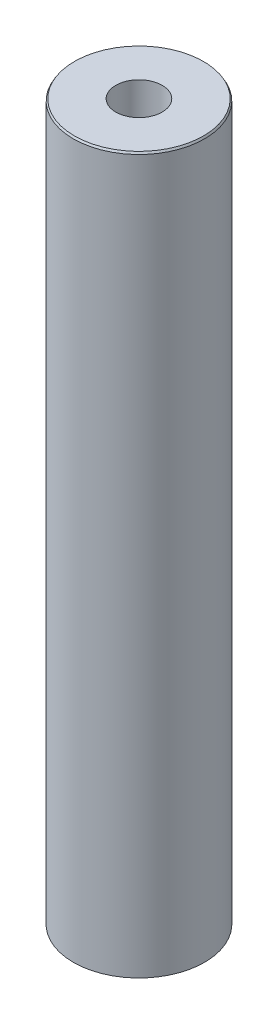
ISO-10303-21;
HEADER;
FILE_DESCRIPTION(('STEP AP214'),'2;1');
FILE_NAME('part.step','',(''),(''),'','','');
FILE_SCHEMA(('AUTOMOTIVE_DESIGN { 1 0 10303 214 1 1 1 1 }'));
ENDSEC;
DATA;
#1=APPLICATION_CONTEXT('core data for automotive mechanical design processes');
#2=APPLICATION_PROTOCOL_DEFINITION('international standard','automotive_design',2000,#1);
#3=PRODUCT_CONTEXT('',#1,'mechanical');
#4=PRODUCT('Part','Part','',(#3));
#5=PRODUCT_RELATED_PRODUCT_CATEGORY('part','',(#4));
#6=PRODUCT_DEFINITION_FORMATION('','',#4);
#7=PRODUCT_DEFINITION_CONTEXT('part definition',#1,'design');
#8=PRODUCT_DEFINITION('design','',#6,#7);
#9=PRODUCT_DEFINITION_SHAPE('','',#8);
#10=(LENGTH_UNIT() NAMED_UNIT(*) SI_UNIT(.MILLI.,.METRE.));
#11=(NAMED_UNIT(*) PLANE_ANGLE_UNIT() SI_UNIT($,.RADIAN.));
#12=(NAMED_UNIT(*) SI_UNIT($,.STERADIAN.) SOLID_ANGLE_UNIT());
#13=UNCERTAINTY_MEASURE_WITH_UNIT(LENGTH_MEASURE(1.E-05),#10,'distance_accuracy_value','');
#14=(GEOMETRIC_REPRESENTATION_CONTEXT(3) GLOBAL_UNCERTAINTY_ASSIGNED_CONTEXT((#13)) GLOBAL_UNIT_ASSIGNED_CONTEXT((#10,
#11,#12)) REPRESENTATION_CONTEXT('',''));
#15=CARTESIAN_POINT('',(0.,0.,0.));
#16=DIRECTION('',(0.,0.,1.));
#17=DIRECTION('',(1.,0.,0.));
#18=AXIS2_PLACEMENT_3D('',#15,#16,#17);
#19=CARTESIAN_POINT('',(0.,600.,0.));
#20=DIRECTION('',(0.,-1.,0.));
#21=DIRECTION('',(0.,0.,-1.));
#22=AXIS2_PLACEMENT_3D('',#19,#20,#21);
#23=CYLINDRICAL_SURFACE('',#22,55.);
#24=CARTESIAN_POINT('',(0.,598.37962724794,0.));
#25=DIRECTION('',(0.,1.,0.));
#26=DIRECTION('',(0.,0.,1.));
#27=AXIS2_PLACEMENT_3D('',#24,#25,#26);
#28=CIRCLE('',#27,55.);
#29=CARTESIAN_POINT('',(0.,598.37962724794,55.));
#30=VERTEX_POINT('',#29);
#31=EDGE_CURVE('E50',#30,#30,#28,.F.);
#32=ORIENTED_EDGE('',*,*,#31,.T.);
#33=EDGE_LOOP('',(#32));
#34=FACE_BOUND('',#33,.T.);
#35=CARTESIAN_POINT('',(0.,0.935522644589515,0.));
#36=DIRECTION('',(0.,1.,0.));
#37=DIRECTION('',(0.,0.,1.));
#38=AXIS2_PLACEMENT_3D('',#35,#36,#37);
#39=CIRCLE('',#38,55.);
#40=CARTESIAN_POINT('',(0.,0.935522644589515,55.));
#41=VERTEX_POINT('',#40);
#42=EDGE_CURVE('E51',#41,#41,#39,.T.);
#43=ORIENTED_EDGE('',*,*,#42,.T.);
#44=EDGE_LOOP('',(#43));
#45=FACE_BOUND('',#44,.T.);
#46=ADVANCED_FACE('F39',(#34,#45),#23,.T.);
#47=CARTESIAN_POINT('',(0.,600.,0.));
#48=DIRECTION('',(0.,1.,0.));
#49=DIRECTION('',(0.,0.,1.));
#50=AXIS2_PLACEMENT_3D('',#47,#48,#49);
#51=PLANE('',#50);
#52=CARTESIAN_POINT('',(0.,600.,0.));
#53=DIRECTION('',(0.,1.,0.));
#54=DIRECTION('',(0.,0.,1.));
#55=AXIS2_PLACEMENT_3D('',#52,#53,#54);
#56=CIRCLE('',#55,54.0644773554105);
#57=CARTESIAN_POINT('',(0.,600.,54.0644773554105));
#58=VERTEX_POINT('',#57);
#59=EDGE_CURVE('E54',#58,#58,#56,.T.);
#60=ORIENTED_EDGE('',*,*,#59,.T.);
#61=EDGE_LOOP('',(#60));
#62=FACE_BOUND('',#61,.T.);
#63=CARTESIAN_POINT('',(0.,600.,0.));
#64=DIRECTION('',(0.,1.,0.));
#65=DIRECTION('',(0.,0.,1.));
#66=AXIS2_PLACEMENT_3D('',#63,#64,#65);
#67=CIRCLE('',#66,19.4403279676686);
#68=CARTESIAN_POINT('',(0.,600.,19.4403279676686));
#69=VERTEX_POINT('',#68);
#70=EDGE_CURVE('E58',#69,#69,#67,.T.);
#71=ORIENTED_EDGE('',*,*,#70,.F.);
#72=EDGE_LOOP('',(#71));
#73=FACE_BOUND('',#72,.T.);
#74=ADVANCED_FACE('F69',(#62,#73),#51,.T.);
#75=CARTESIAN_POINT('',(0.,0.,0.));
#76=DIRECTION('',(0.,1.,0.));
#77=DIRECTION('',(0.,0.,1.));
#78=AXIS2_PLACEMENT_3D('',#75,#76,#77);
#79=PLANE('',#78);
#80=CARTESIAN_POINT('',(0.,0.,0.));
#81=DIRECTION('',(0.,1.,0.));
#82=DIRECTION('',(0.,0.,1.));
#83=AXIS2_PLACEMENT_3D('',#80,#81,#82);
#84=CIRCLE('',#83,53.3796272479398);
#85=CARTESIAN_POINT('',(0.,0.,53.3796272479398));
#86=VERTEX_POINT('',#85);
#87=EDGE_CURVE('E10',#86,#86,#84,.F.);
#88=ORIENTED_EDGE('',*,*,#87,.T.);
#89=EDGE_LOOP('',(#88));
#90=FACE_BOUND('',#89,.T.);
#91=CARTESIAN_POINT('',(0.,0.,0.));
#92=DIRECTION('',(0.,1.,0.));
#93=DIRECTION('',(0.,0.,1.));
#94=AXIS2_PLACEMENT_3D('',#91,#92,#93);
#95=CIRCLE('',#94,19.4403279676686);
#96=CARTESIAN_POINT('',(0.,0.,19.4403279676686));
#97=VERTEX_POINT('',#96);
#98=EDGE_CURVE('E63',#97,#97,#95,.T.);
#99=ORIENTED_EDGE('',*,*,#98,.T.);
#100=EDGE_LOOP('',(#99));
#101=FACE_BOUND('',#100,.T.);
#102=ADVANCED_FACE('F75',(#90,#101),#79,.F.);
#103=CARTESIAN_POINT('',(0.,600.,0.));
#104=DIRECTION('',(0.,-1.,0.));
#105=DIRECTION('',(0.,0.,-1.));
#106=AXIS2_PLACEMENT_3D('',#103,#104,#105);
#107=CYLINDRICAL_SURFACE('',#106,19.4403279676686);
#108=ORIENTED_EDGE('',*,*,#70,.T.);
#109=EDGE_LOOP('',(#108));
#110=FACE_BOUND('',#109,.T.);
#111=ORIENTED_EDGE('',*,*,#98,.F.);
#112=EDGE_LOOP('',(#111));
#113=FACE_BOUND('',#112,.T.);
#114=ADVANCED_FACE('F70',(#110,#113),#107,.F.);
#115=CARTESIAN_POINT('',(0.,600.,0.));
#116=DIRECTION('',(0.,-1.,0.));
#117=DIRECTION('',(0.,0.,-1.));
#118=AXIS2_PLACEMENT_3D('',#115,#116,#117);
#119=CONICAL_SURFACE('',#118,54.0644773554105,0.523598775598295);
#120=ORIENTED_EDGE('',*,*,#31,.F.);
#121=EDGE_LOOP('',(#120));
#122=FACE_BOUND('',#121,.T.);
#123=ORIENTED_EDGE('',*,*,#59,.F.);
#124=EDGE_LOOP('',(#123));
#125=FACE_BOUND('',#124,.T.);
#126=ADVANCED_FACE('F81',(#122,#125),#119,.T.);
#127=CARTESIAN_POINT('',(0.,0.935522644589515,0.));
#128=DIRECTION('',(0.,1.,0.));
#129=DIRECTION('',(0.,0.,1.));
#130=AXIS2_PLACEMENT_3D('',#127,#128,#129);
#131=CONICAL_SURFACE('',#130,55.,1.04719755119658);
#132=ORIENTED_EDGE('',*,*,#87,.F.);
#133=EDGE_LOOP('',(#132));
#134=FACE_BOUND('',#133,.T.);
#135=ORIENTED_EDGE('',*,*,#42,.F.);
#136=EDGE_LOOP('',(#135));
#137=FACE_BOUND('',#136,.T.);
#138=ADVANCED_FACE('F45',(#134,#137),#131,.T.);
#139=CLOSED_SHELL('',(#46,#74,#102,#114,#126,#138));
#140=MANIFOLD_SOLID_BREP('B2',#139);
#141=ADVANCED_BREP_SHAPE_REPRESENTATION('',(#18,#140),#14);
#142=SHAPE_DEFINITION_REPRESENTATION(#9,#141);
ENDSEC;
END-ISO-10303-21;
